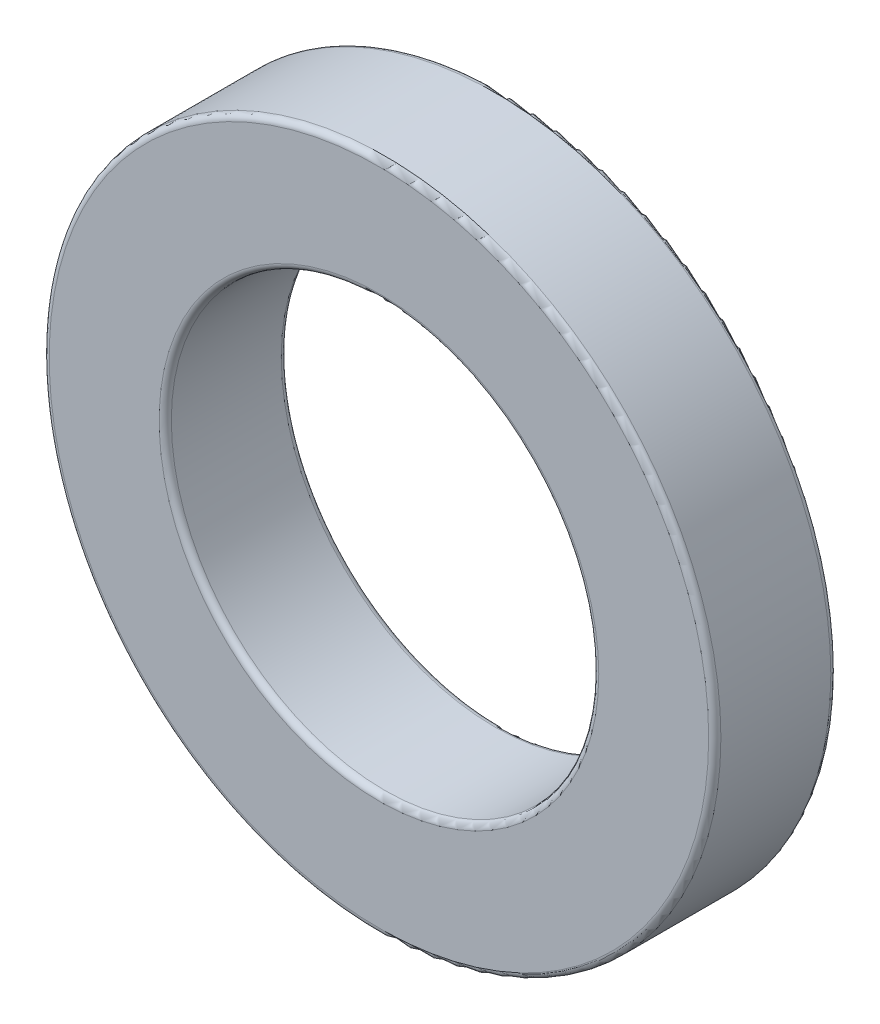
ISO-10303-21;
HEADER;
FILE_DESCRIPTION(('STEP AP214'),'2;1');
FILE_NAME('part.step','',(''),(''),'','','');
FILE_SCHEMA(('AUTOMOTIVE_DESIGN { 1 0 10303 214 1 1 1 1 }'));
ENDSEC;
DATA;
#1=APPLICATION_CONTEXT('core data for automotive mechanical design processes');
#2=APPLICATION_PROTOCOL_DEFINITION('international standard','automotive_design',2000,#1);
#3=PRODUCT_CONTEXT('',#1,'mechanical');
#4=PRODUCT('Part','Part','',(#3));
#5=PRODUCT_RELATED_PRODUCT_CATEGORY('part','',(#4));
#6=PRODUCT_DEFINITION_FORMATION('','',#4);
#7=PRODUCT_DEFINITION_CONTEXT('part definition',#1,'design');
#8=PRODUCT_DEFINITION('design','',#6,#7);
#9=PRODUCT_DEFINITION_SHAPE('','',#8);
#10=(LENGTH_UNIT() NAMED_UNIT(*) SI_UNIT(.MILLI.,.METRE.));
#11=(NAMED_UNIT(*) PLANE_ANGLE_UNIT() SI_UNIT($,.RADIAN.));
#12=(NAMED_UNIT(*) SI_UNIT($,.STERADIAN.) SOLID_ANGLE_UNIT());
#13=UNCERTAINTY_MEASURE_WITH_UNIT(LENGTH_MEASURE(1.E-05),#10,'distance_accuracy_value','');
#14=(GEOMETRIC_REPRESENTATION_CONTEXT(3) GLOBAL_UNCERTAINTY_ASSIGNED_CONTEXT((#13)) GLOBAL_UNIT_ASSIGNED_CONTEXT((#10,
#11,#12)) REPRESENTATION_CONTEXT('',''));
#15=CARTESIAN_POINT('',(0.,0.,0.));
#16=DIRECTION('',(0.,0.,1.));
#17=DIRECTION('',(1.,0.,0.));
#18=AXIS2_PLACEMENT_3D('',#15,#16,#17);
#19=CARTESIAN_POINT('',(0.,0.,0.));
#20=DIRECTION('',(0.,0.,1.));
#21=DIRECTION('',(1.,0.,0.));
#22=AXIS2_PLACEMENT_3D('',#19,#20,#21);
#23=PLANE('',#22);
#24=CARTESIAN_POINT('',(0.,0.,0.));
#25=DIRECTION('',(0.,0.,1.));
#26=DIRECTION('',(1.,0.,0.));
#27=AXIS2_PLACEMENT_3D('',#24,#25,#26);
#28=CIRCLE('',#27,36.);
#29=CARTESIAN_POINT('',(36.,0.,0.));
#30=VERTEX_POINT('',#29);
#31=EDGE_CURVE('E10',#30,#30,#28,.T.);
#32=ORIENTED_EDGE('',*,*,#31,.T.);
#33=EDGE_LOOP('',(#32));
#34=FACE_BOUND('',#33,.T.);
#35=CARTESIAN_POINT('',(0.,0.,0.));
#36=DIRECTION('',(0.,0.,-1.));
#37=DIRECTION('',(-1.,0.,0.));
#38=AXIS2_PLACEMENT_3D('',#35,#36,#37);
#39=CIRCLE('',#38,41.45);
#40=CARTESIAN_POINT('',(-41.45,0.,0.));
#41=VERTEX_POINT('',#40);
#42=EDGE_CURVE('E74',#41,#41,#39,.T.);
#43=ORIENTED_EDGE('',*,*,#42,.T.);
#44=EDGE_LOOP('',(#43));
#45=FACE_BOUND('',#44,.T.);
#46=ADVANCED_FACE('F35',(#34,#45),#23,.F.);
#47=CARTESIAN_POINT('',(0.,0.,20.));
#48=DIRECTION('',(0.,0.,1.));
#49=DIRECTION('',(1.,0.,0.));
#50=AXIS2_PLACEMENT_3D('',#47,#48,#49);
#51=PLANE('',#50);
#52=CARTESIAN_POINT('',(0.,0.,20.));
#53=DIRECTION('',(0.,0.,1.));
#54=DIRECTION('',(1.,0.,0.));
#55=AXIS2_PLACEMENT_3D('',#52,#53,#54);
#56=CIRCLE('',#55,36.);
#57=CARTESIAN_POINT('',(36.,0.,20.));
#58=VERTEX_POINT('',#57);
#59=EDGE_CURVE('E55',#58,#58,#56,.F.);
#60=ORIENTED_EDGE('',*,*,#59,.T.);
#61=EDGE_LOOP('',(#60));
#62=FACE_BOUND('',#61,.T.);
#63=CARTESIAN_POINT('',(0.,0.,20.));
#64=DIRECTION('',(0.,0.,1.));
#65=DIRECTION('',(1.,0.,0.));
#66=AXIS2_PLACEMENT_3D('',#63,#64,#65);
#67=CIRCLE('',#66,54.);
#68=CARTESIAN_POINT('',(54.,0.,20.));
#69=VERTEX_POINT('',#68);
#70=EDGE_CURVE('E58',#69,#69,#67,.T.);
#71=ORIENTED_EDGE('',*,*,#70,.T.);
#72=EDGE_LOOP('',(#71));
#73=FACE_BOUND('',#72,.T.);
#74=ADVANCED_FACE('F98',(#62,#73),#51,.T.);
#75=CARTESIAN_POINT('',(0.,0.,0.));
#76=DIRECTION('',(0.,0.,-1.));
#77=DIRECTION('',(-1.,0.,0.));
#78=AXIS2_PLACEMENT_3D('',#75,#76,#77);
#79=CIRCLE('',#78,49.95);
#80=CARTESIAN_POINT('',(-49.95,0.,0.));
#81=VERTEX_POINT('',#80);
#82=EDGE_CURVE('E68',#81,#81,#79,.T.);
#83=ORIENTED_EDGE('',*,*,#82,.F.);
#84=EDGE_LOOP('',(#83));
#85=FACE_BOUND('',#84,.T.);
#86=CARTESIAN_POINT('',(0.,0.,0.));
#87=DIRECTION('',(0.,0.,1.));
#88=DIRECTION('',(1.,0.,0.));
#89=AXIS2_PLACEMENT_3D('',#86,#87,#88);
#90=CIRCLE('',#89,54.);
#91=CARTESIAN_POINT('',(54.,0.,0.));
#92=VERTEX_POINT('',#91);
#93=EDGE_CURVE('E42',#92,#92,#90,.F.);
#94=ORIENTED_EDGE('',*,*,#93,.T.);
#95=EDGE_LOOP('',(#94));
#96=FACE_BOUND('',#95,.T.);
#97=ADVANCED_FACE('F95',(#85,#96),#23,.F.);
#98=CARTESIAN_POINT('',(0.,0.,20.));
#99=DIRECTION('',(0.,0.,-1.));
#100=DIRECTION('',(-1.,0.,0.));
#101=AXIS2_PLACEMENT_3D('',#98,#99,#100);
#102=CYLINDRICAL_SURFACE('',#101,55.);
#103=CARTESIAN_POINT('',(0.,0.,19.));
#104=DIRECTION('',(0.,0.,1.));
#105=DIRECTION('',(1.,0.,0.));
#106=AXIS2_PLACEMENT_3D('',#103,#104,#105);
#107=CIRCLE('',#106,55.);
#108=CARTESIAN_POINT('',(55.,0.,19.));
#109=VERTEX_POINT('',#108);
#110=EDGE_CURVE('E46',#109,#109,#107,.F.);
#111=ORIENTED_EDGE('',*,*,#110,.T.);
#112=EDGE_LOOP('',(#111));
#113=FACE_BOUND('',#112,.T.);
#114=CARTESIAN_POINT('',(0.,0.,1.));
#115=DIRECTION('',(0.,0.,1.));
#116=DIRECTION('',(1.,0.,0.));
#117=AXIS2_PLACEMENT_3D('',#114,#115,#116);
#118=CIRCLE('',#117,55.);
#119=CARTESIAN_POINT('',(55.,0.,1.));
#120=VERTEX_POINT('',#119);
#121=EDGE_CURVE('E50',#120,#120,#118,.T.);
#122=ORIENTED_EDGE('',*,*,#121,.T.);
#123=EDGE_LOOP('',(#122));
#124=FACE_BOUND('',#123,.T.);
#125=ADVANCED_FACE('F97',(#113,#124),#102,.T.);
#126=CARTESIAN_POINT('',(0.,0.,20.));
#127=DIRECTION('',(0.,0.,-1.));
#128=DIRECTION('',(-1.,0.,0.));
#129=AXIS2_PLACEMENT_3D('',#126,#127,#128);
#130=CYLINDRICAL_SURFACE('',#129,35.);
#131=CARTESIAN_POINT('',(0.,0.,19.));
#132=DIRECTION('',(0.,0.,1.));
#133=DIRECTION('',(1.,0.,0.));
#134=AXIS2_PLACEMENT_3D('',#131,#132,#133);
#135=CIRCLE('',#134,35.);
#136=CARTESIAN_POINT('',(35.,0.,19.));
#137=VERTEX_POINT('',#136);
#138=EDGE_CURVE('E61',#137,#137,#135,.T.);
#139=ORIENTED_EDGE('',*,*,#138,.T.);
#140=EDGE_LOOP('',(#139));
#141=FACE_BOUND('',#140,.T.);
#142=CARTESIAN_POINT('',(0.,0.,1.));
#143=DIRECTION('',(0.,0.,1.));
#144=DIRECTION('',(1.,0.,0.));
#145=AXIS2_PLACEMENT_3D('',#142,#143,#144);
#146=CIRCLE('',#145,35.);
#147=CARTESIAN_POINT('',(35.,0.,1.));
#148=VERTEX_POINT('',#147);
#149=EDGE_CURVE('E64',#148,#148,#146,.F.);
#150=ORIENTED_EDGE('',*,*,#149,.T.);
#151=EDGE_LOOP('',(#150));
#152=FACE_BOUND('',#151,.T.);
#153=ADVANCED_FACE('F104',(#141,#152),#130,.F.);
#154=CARTESIAN_POINT('',(0.,0.,19.));
#155=DIRECTION('',(0.,0.,1.));
#156=DIRECTION('',(1.,0.,0.));
#157=AXIS2_PLACEMENT_3D('',#154,#155,#156);
#158=TOROIDAL_SURFACE('',#157,36.,1.);
#159=ORIENTED_EDGE('',*,*,#59,.F.);
#160=EDGE_LOOP('',(#159));
#161=FACE_BOUND('',#160,.T.);
#162=ORIENTED_EDGE('',*,*,#138,.F.);
#163=EDGE_LOOP('',(#162));
#164=FACE_BOUND('',#163,.T.);
#165=ADVANCED_FACE('F120',(#161,#164),#158,.T.);
#166=CARTESIAN_POINT('',(0.,0.,19.));
#167=DIRECTION('',(0.,0.,1.));
#168=DIRECTION('',(1.,0.,0.));
#169=AXIS2_PLACEMENT_3D('',#166,#167,#168);
#170=TOROIDAL_SURFACE('',#169,54.,1.);
#171=ORIENTED_EDGE('',*,*,#110,.F.);
#172=EDGE_LOOP('',(#171));
#173=FACE_BOUND('',#172,.T.);
#174=ORIENTED_EDGE('',*,*,#70,.F.);
#175=EDGE_LOOP('',(#174));
#176=FACE_BOUND('',#175,.T.);
#177=ADVANCED_FACE('F125',(#173,#176),#170,.T.);
#178=CARTESIAN_POINT('',(0.,0.,1.));
#179=DIRECTION('',(0.,0.,1.));
#180=DIRECTION('',(1.,0.,0.));
#181=AXIS2_PLACEMENT_3D('',#178,#179,#180);
#182=TOROIDAL_SURFACE('',#181,36.,1.);
#183=ORIENTED_EDGE('',*,*,#149,.F.);
#184=EDGE_LOOP('',(#183));
#185=FACE_BOUND('',#184,.T.);
#186=ORIENTED_EDGE('',*,*,#31,.F.);
#187=EDGE_LOOP('',(#186));
#188=FACE_BOUND('',#187,.T.);
#189=ADVANCED_FACE('F132',(#185,#188),#182,.T.);
#190=CARTESIAN_POINT('',(0.,0.,1.));
#191=DIRECTION('',(0.,0.,1.));
#192=DIRECTION('',(1.,0.,0.));
#193=AXIS2_PLACEMENT_3D('',#190,#191,#192);
#194=TOROIDAL_SURFACE('',#193,54.,1.);
#195=ORIENTED_EDGE('',*,*,#93,.F.);
#196=EDGE_LOOP('',(#195));
#197=FACE_BOUND('',#196,.T.);
#198=ORIENTED_EDGE('',*,*,#121,.F.);
#199=EDGE_LOOP('',(#198));
#200=FACE_BOUND('',#199,.T.);
#201=ADVANCED_FACE('F37',(#197,#200),#194,.T.);
#202=CARTESIAN_POINT('',(0.,0.,4.));
#203=DIRECTION('',(0.,0.,-1.));
#204=DIRECTION('',(-1.,0.,0.));
#205=AXIS2_PLACEMENT_3D('',#202,#203,#204);
#206=CYLINDRICAL_SURFACE('',#205,49.95);
#207=CARTESIAN_POINT('',(0.,0.,4.));
#208=DIRECTION('',(0.,0.,-1.));
#209=DIRECTION('',(-1.,0.,0.));
#210=AXIS2_PLACEMENT_3D('',#207,#208,#209);
#211=CIRCLE('',#210,49.95);
#212=CARTESIAN_POINT('',(-49.95,0.,4.));
#213=VERTEX_POINT('',#212);
#214=EDGE_CURVE('E67',#213,#213,#211,.T.);
#215=ORIENTED_EDGE('',*,*,#214,.F.);
#216=EDGE_LOOP('',(#215));
#217=FACE_BOUND('',#216,.T.);
#218=ORIENTED_EDGE('',*,*,#82,.T.);
#219=EDGE_LOOP('',(#218));
#220=FACE_BOUND('',#219,.T.);
#221=ADVANCED_FACE('F86',(#217,#220),#206,.F.);
#222=CARTESIAN_POINT('',(0.,0.,4.));
#223=DIRECTION('',(0.,0.,-1.));
#224=DIRECTION('',(-1.,0.,0.));
#225=AXIS2_PLACEMENT_3D('',#222,#223,#224);
#226=PLANE('',#225);
#227=CARTESIAN_POINT('',(0.,0.,4.));
#228=DIRECTION('',(0.,0.,-1.));
#229=DIRECTION('',(-1.,0.,0.));
#230=AXIS2_PLACEMENT_3D('',#227,#228,#229);
#231=CIRCLE('',#230,41.45);
#232=CARTESIAN_POINT('',(-41.45,0.,4.));
#233=VERTEX_POINT('',#232);
#234=EDGE_CURVE('E71',#233,#233,#231,.T.);
#235=ORIENTED_EDGE('',*,*,#234,.F.);
#236=EDGE_LOOP('',(#235));
#237=FACE_BOUND('',#236,.T.);
#238=ORIENTED_EDGE('',*,*,#214,.T.);
#239=EDGE_LOOP('',(#238));
#240=FACE_BOUND('',#239,.T.);
#241=ADVANCED_FACE('F83',(#237,#240),#226,.T.);
#242=CARTESIAN_POINT('',(0.,0.,4.));
#243=DIRECTION('',(0.,0.,-1.));
#244=DIRECTION('',(-1.,0.,0.));
#245=AXIS2_PLACEMENT_3D('',#242,#243,#244);
#246=CYLINDRICAL_SURFACE('',#245,41.45);
#247=ORIENTED_EDGE('',*,*,#234,.T.);
#248=EDGE_LOOP('',(#247));
#249=FACE_BOUND('',#248,.T.);
#250=ORIENTED_EDGE('',*,*,#42,.F.);
#251=EDGE_LOOP('',(#250));
#252=FACE_BOUND('',#251,.T.);
#253=ADVANCED_FACE('F80',(#249,#252),#246,.T.);
#254=CLOSED_SHELL('',(#46,#74,#97,#125,#153,#165,#177,#189,#201,#221,#241,#253));
#255=MANIFOLD_SOLID_BREP('B2',#254);
#256=ADVANCED_BREP_SHAPE_REPRESENTATION('',(#18,#255),#14);
#257=SHAPE_DEFINITION_REPRESENTATION(#9,#256);
ENDSEC;
END-ISO-10303-21;
